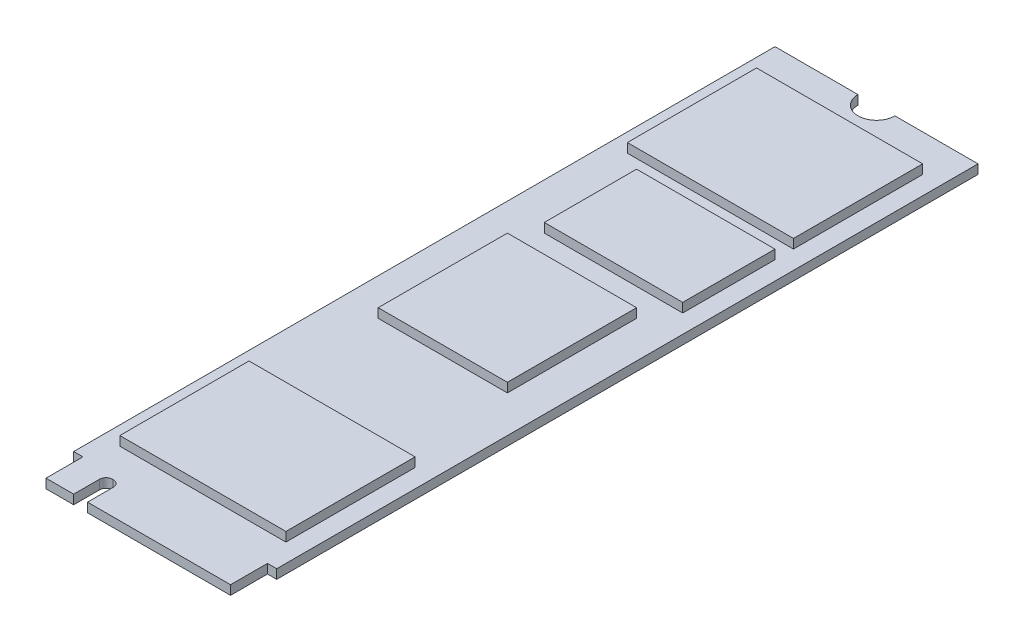
ISO-10303-21;
HEADER;
FILE_DESCRIPTION(('STEP AP214'),'2;1');
FILE_NAME('part.step','',(''),(''),'','','');
FILE_SCHEMA(('AUTOMOTIVE_DESIGN { 1 0 10303 214 1 1 1 1 }'));
ENDSEC;
DATA;
#1=APPLICATION_CONTEXT('core data for automotive mechanical design processes');
#2=APPLICATION_PROTOCOL_DEFINITION('international standard','automotive_design',2000,#1);
#3=PRODUCT_CONTEXT('',#1,'mechanical');
#4=PRODUCT('Part','Part','',(#3));
#5=PRODUCT_RELATED_PRODUCT_CATEGORY('part','',(#4));
#6=PRODUCT_DEFINITION_FORMATION('','',#4);
#7=PRODUCT_DEFINITION_CONTEXT('part definition',#1,'design');
#8=PRODUCT_DEFINITION('design','',#6,#7);
#9=PRODUCT_DEFINITION_SHAPE('','',#8);
#10=(LENGTH_UNIT() NAMED_UNIT(*) SI_UNIT(.MILLI.,.METRE.));
#11=(NAMED_UNIT(*) PLANE_ANGLE_UNIT() SI_UNIT($,.RADIAN.));
#12=(NAMED_UNIT(*) SI_UNIT($,.STERADIAN.) SOLID_ANGLE_UNIT());
#13=UNCERTAINTY_MEASURE_WITH_UNIT(LENGTH_MEASURE(1.E-05),#10,'distance_accuracy_value','');
#14=(GEOMETRIC_REPRESENTATION_CONTEXT(3) GLOBAL_UNCERTAINTY_ASSIGNED_CONTEXT((#13)) GLOBAL_UNIT_ASSIGNED_CONTEXT((#10,
#11,#12)) REPRESENTATION_CONTEXT('',''));
#15=CARTESIAN_POINT('',(0.,0.,0.));
#16=DIRECTION('',(0.,0.,1.));
#17=DIRECTION('',(1.,0.,0.));
#18=AXIS2_PLACEMENT_3D('',#15,#16,#17);
#19=CARTESIAN_POINT('',(-6.19999999999999,1.,37.2));
#20=DIRECTION('',(0.,1.,0.));
#21=DIRECTION('',(0.,0.,1.));
#22=AXIS2_PLACEMENT_3D('',#19,#20,#21);
#23=PLANE('',#22);
#24=CARTESIAN_POINT('',(0.,1.,-40.));
#25=DIRECTION('',(0.,1.,0.));
#26=DIRECTION('',(0.,0.,1.));
#27=AXIS2_PLACEMENT_3D('',#24,#25,#26);
#28=CIRCLE('',#27,2.);
#29=CARTESIAN_POINT('',(-2.00000000000001,1.,-40.));
#30=VERTEX_POINT('',#29);
#31=CARTESIAN_POINT('',(2.,1.,-40.));
#32=VERTEX_POINT('',#31);
#33=EDGE_CURVE('E369',#30,#32,#28,.T.);
#34=ORIENTED_EDGE('',*,*,#33,.F.);
#35=DIRECTION('',(-1.,0.,0.));
#36=VECTOR('',#35,1.);
#37=CARTESIAN_POINT('',(11.,1.,-40.));
#38=LINE('',#37,#36);
#39=CARTESIAN_POINT('',(-11.,1.,-40.));
#40=VERTEX_POINT('',#39);
#41=EDGE_CURVE('E392',#30,#40,#38,.T.);
#42=ORIENTED_EDGE('',*,*,#41,.T.);
#43=DIRECTION('',(0.,0.,1.));
#44=VECTOR('',#43,1.);
#45=CARTESIAN_POINT('',(-11.,1.,36.));
#46=LINE('',#45,#44);
#47=CARTESIAN_POINT('',(-11.,1.,36.));
#48=VERTEX_POINT('',#47);
#49=EDGE_CURVE('E396',#40,#48,#46,.T.);
#50=ORIENTED_EDGE('',*,*,#49,.T.);
#51=DIRECTION('',(1.,0.,0.));
#52=VECTOR('',#51,1.);
#53=CARTESIAN_POINT('',(-9.99999999999999,1.,36.));
#54=LINE('',#53,#52);
#55=CARTESIAN_POINT('',(-9.99999999999999,1.,36.));
#56=VERTEX_POINT('',#55);
#57=EDGE_CURVE('E398',#48,#56,#54,.T.);
#58=ORIENTED_EDGE('',*,*,#57,.T.);
#59=DIRECTION('',(0.,0.,1.));
#60=VECTOR('',#59,1.);
#61=CARTESIAN_POINT('',(-9.99999999999999,1.,40.));
#62=LINE('',#61,#60);
#63=CARTESIAN_POINT('',(-9.99999999999999,1.,40.));
#64=VERTEX_POINT('',#63);
#65=EDGE_CURVE('E400',#56,#64,#62,.T.);
#66=ORIENTED_EDGE('',*,*,#65,.T.);
#67=DIRECTION('',(1.,0.,0.));
#68=VECTOR('',#67,1.);
#69=CARTESIAN_POINT('',(-6.99999999999999,1.,40.));
#70=LINE('',#69,#68);
#71=CARTESIAN_POINT('',(-6.99999999999999,1.,40.));
#72=VERTEX_POINT('',#71);
#73=EDGE_CURVE('E402',#64,#72,#70,.T.);
#74=ORIENTED_EDGE('',*,*,#73,.T.);
#75=DIRECTION('',(0.,0.,-1.));
#76=VECTOR('',#75,1.);
#77=CARTESIAN_POINT('',(-7.,1.,37.2));
#78=LINE('',#77,#76);
#79=CARTESIAN_POINT('',(-7.,1.,37.2));
#80=VERTEX_POINT('',#79);
#81=EDGE_CURVE('E404',#72,#80,#78,.T.);
#82=ORIENTED_EDGE('',*,*,#81,.T.);
#83=CARTESIAN_POINT('',(-6.3,1.,37.2));
#84=DIRECTION('',(0.,-1.,0.));
#85=DIRECTION('',(0.,0.,1.));
#86=AXIS2_PLACEMENT_3D('',#83,#84,#85);
#87=CIRCLE('',#86,0.7);
#88=CARTESIAN_POINT('',(-6.29999999999999,1.,36.5));
#89=VERTEX_POINT('',#88);
#90=EDGE_CURVE('E406',#80,#89,#87,.T.);
#91=ORIENTED_EDGE('',*,*,#90,.T.);
#92=DIRECTION('',(1.,0.,0.));
#93=VECTOR('',#92,1.);
#94=CARTESIAN_POINT('',(-6.2,1.,36.5));
#95=LINE('',#94,#93);
#96=CARTESIAN_POINT('',(-6.2,1.,36.5));
#97=VERTEX_POINT('',#96);
#98=EDGE_CURVE('E408',#89,#97,#95,.T.);
#99=ORIENTED_EDGE('',*,*,#98,.T.);
#100=CARTESIAN_POINT('',(-6.19999999999999,1.,37.2));
#101=DIRECTION('',(0.,-1.,0.));
#102=DIRECTION('',(0.,0.,1.));
#103=AXIS2_PLACEMENT_3D('',#100,#101,#102);
#104=CIRCLE('',#103,0.7);
#105=CARTESIAN_POINT('',(-5.49999999999999,1.,37.2));
#106=VERTEX_POINT('',#105);
#107=EDGE_CURVE('E378',#97,#106,#104,.T.);
#108=ORIENTED_EDGE('',*,*,#107,.T.);
#109=DIRECTION('',(0.,0.,1.));
#110=VECTOR('',#109,1.);
#111=CARTESIAN_POINT('',(-5.49999999999999,1.,40.));
#112=LINE('',#111,#110);
#113=CARTESIAN_POINT('',(-5.49999999999999,1.,40.));
#114=VERTEX_POINT('',#113);
#115=EDGE_CURVE('E381',#106,#114,#112,.T.);
#116=ORIENTED_EDGE('',*,*,#115,.T.);
#117=DIRECTION('',(1.,0.,0.));
#118=VECTOR('',#117,1.);
#119=CARTESIAN_POINT('',(10.,1.,40.));
#120=LINE('',#119,#118);
#121=CARTESIAN_POINT('',(10.,1.,40.));
#122=VERTEX_POINT('',#121);
#123=EDGE_CURVE('E384',#114,#122,#120,.T.);
#124=ORIENTED_EDGE('',*,*,#123,.T.);
#125=DIRECTION('',(0.,0.,-1.));
#126=VECTOR('',#125,1.);
#127=CARTESIAN_POINT('',(10.,1.,36.));
#128=LINE('',#127,#126);
#129=CARTESIAN_POINT('',(10.,1.,36.));
#130=VERTEX_POINT('',#129);
#131=EDGE_CURVE('E386',#122,#130,#128,.T.);
#132=ORIENTED_EDGE('',*,*,#131,.T.);
#133=DIRECTION('',(1.,0.,0.));
#134=VECTOR('',#133,1.);
#135=CARTESIAN_POINT('',(11.,1.,36.));
#136=LINE('',#135,#134);
#137=CARTESIAN_POINT('',(11.,1.,36.));
#138=VERTEX_POINT('',#137);
#139=EDGE_CURVE('E388',#130,#138,#136,.T.);
#140=ORIENTED_EDGE('',*,*,#139,.T.);
#141=DIRECTION('',(0.,0.,-1.));
#142=VECTOR('',#141,1.);
#143=CARTESIAN_POINT('',(11.,1.,-40.));
#144=LINE('',#143,#142);
#145=CARTESIAN_POINT('',(11.,1.,-40.));
#146=VERTEX_POINT('',#145);
#147=EDGE_CURVE('E390',#138,#146,#144,.T.);
#148=ORIENTED_EDGE('',*,*,#147,.T.);
#149=EDGE_CURVE('E393',#146,#32,#38,.T.);
#150=ORIENTED_EDGE('',*,*,#149,.T.);
#151=EDGE_LOOP('',(#34,#42,#50,#58,#66,#74,#82,#91,#99,#108,#116,#124,#132,#140,#148,#150));
#152=FACE_BOUND('',#151,.T.);
#153=DIRECTION('',(1.,0.,0.));
#154=VECTOR('',#153,1.);
#155=CARTESIAN_POINT('',(-9.,1.,-22.));
#156=LINE('',#155,#154);
#157=CARTESIAN_POINT('',(-9.,1.,-22.));
#158=VERTEX_POINT('',#157);
#159=CARTESIAN_POINT('',(9.,1.,-22.));
#160=VERTEX_POINT('',#159);
#161=EDGE_CURVE('E354',#158,#160,#156,.T.);
#162=ORIENTED_EDGE('',*,*,#161,.F.);
#163=DIRECTION('',(0.,0.,1.));
#164=VECTOR('',#163,1.);
#165=CARTESIAN_POINT('',(-9.00000000000001,1.,-36.));
#166=LINE('',#165,#164);
#167=CARTESIAN_POINT('',(-9.00000000000001,1.,-36.));
#168=VERTEX_POINT('',#167);
#169=EDGE_CURVE('E340',#168,#158,#166,.T.);
#170=ORIENTED_EDGE('',*,*,#169,.F.);
#171=DIRECTION('',(-1.,0.,0.));
#172=VECTOR('',#171,1.);
#173=CARTESIAN_POINT('',(-9.00000000000001,1.,-36.));
#174=LINE('',#173,#172);
#175=CARTESIAN_POINT('',(8.99999999999999,1.,-36.));
#176=VERTEX_POINT('',#175);
#177=EDGE_CURVE('E345',#176,#168,#174,.T.);
#178=ORIENTED_EDGE('',*,*,#177,.F.);
#179=DIRECTION('',(0.,0.,-1.));
#180=VECTOR('',#179,1.);
#181=CARTESIAN_POINT('',(8.99999999999999,1.,-36.));
#182=LINE('',#181,#180);
#183=EDGE_CURVE('E356',#160,#176,#182,.T.);
#184=ORIENTED_EDGE('',*,*,#183,.F.);
#185=EDGE_LOOP('',(#162,#170,#178,#184));
#186=FACE_BOUND('',#185,.T.);
#187=DIRECTION('',(1.,0.,0.));
#188=VECTOR('',#187,1.);
#189=CARTESIAN_POINT('',(-6.99999999999999,1.,7.00000000000001));
#190=LINE('',#189,#188);
#191=CARTESIAN_POINT('',(-6.99999999999999,1.,7.00000000000001));
#192=VERTEX_POINT('',#191);
#193=CARTESIAN_POINT('',(7.00000000000001,1.,7.00000000000001));
#194=VERTEX_POINT('',#193);
#195=EDGE_CURVE('E325',#192,#194,#190,.T.);
#196=ORIENTED_EDGE('',*,*,#195,.F.);
#197=DIRECTION('',(0.,0.,1.));
#198=VECTOR('',#197,1.);
#199=CARTESIAN_POINT('',(-7.,1.,-6.99999999999999));
#200=LINE('',#199,#198);
#201=CARTESIAN_POINT('',(-7.,1.,-6.99999999999999));
#202=VERTEX_POINT('',#201);
#203=EDGE_CURVE('E311',#202,#192,#200,.T.);
#204=ORIENTED_EDGE('',*,*,#203,.F.);
#205=DIRECTION('',(-1.,0.,0.));
#206=VECTOR('',#205,1.);
#207=CARTESIAN_POINT('',(-7.,1.,-6.99999999999999));
#208=LINE('',#207,#206);
#209=CARTESIAN_POINT('',(7.,1.,-6.99999999999999));
#210=VERTEX_POINT('',#209);
#211=EDGE_CURVE('E316',#210,#202,#208,.T.);
#212=ORIENTED_EDGE('',*,*,#211,.F.);
#213=DIRECTION('',(0.,0.,-1.));
#214=VECTOR('',#213,1.);
#215=CARTESIAN_POINT('',(7.,1.,-6.99999999999999));
#216=LINE('',#215,#214);
#217=EDGE_CURVE('E327',#194,#210,#216,.T.);
#218=ORIENTED_EDGE('',*,*,#217,.F.);
#219=EDGE_LOOP('',(#196,#204,#212,#218));
#220=FACE_BOUND('',#219,.T.);
#221=DIRECTION('',(1.,0.,0.));
#222=VECTOR('',#221,1.);
#223=CARTESIAN_POINT('',(-6.,1.,-9.99999999999999));
#224=LINE('',#223,#222);
#225=CARTESIAN_POINT('',(-6.,1.,-9.99999999999999));
#226=VERTEX_POINT('',#225);
#227=CARTESIAN_POINT('',(9.00000000000001,1.,-9.99999999999999));
#228=VERTEX_POINT('',#227);
#229=EDGE_CURVE('E283',#226,#228,#224,.T.);
#230=ORIENTED_EDGE('',*,*,#229,.F.);
#231=DIRECTION('',(0.,0.,1.));
#232=VECTOR('',#231,1.);
#233=CARTESIAN_POINT('',(-6.,1.,-20.));
#234=LINE('',#233,#232);
#235=CARTESIAN_POINT('',(-6.,1.,-20.));
#236=VERTEX_POINT('',#235);
#237=EDGE_CURVE('E280',#236,#226,#234,.T.);
#238=ORIENTED_EDGE('',*,*,#237,.F.);
#239=DIRECTION('',(-1.,0.,0.));
#240=VECTOR('',#239,1.);
#241=CARTESIAN_POINT('',(-6.,1.,-20.));
#242=LINE('',#241,#240);
#243=CARTESIAN_POINT('',(9.,1.,-20.));
#244=VERTEX_POINT('',#243);
#245=EDGE_CURVE('E292',#244,#236,#242,.T.);
#246=ORIENTED_EDGE('',*,*,#245,.F.);
#247=DIRECTION('',(0.,0.,-1.));
#248=VECTOR('',#247,1.);
#249=CARTESIAN_POINT('',(9.,1.,-20.));
#250=LINE('',#249,#248);
#251=EDGE_CURVE('E300',#228,#244,#250,.T.);
#252=ORIENTED_EDGE('',*,*,#251,.F.);
#253=EDGE_LOOP('',(#230,#238,#246,#252));
#254=FACE_BOUND('',#253,.T.);
#255=DIRECTION('',(1.,0.,0.));
#256=VECTOR('',#255,1.);
#257=CARTESIAN_POINT('',(-9.,1.,33.));
#258=LINE('',#257,#256);
#259=CARTESIAN_POINT('',(-9.,1.,33.));
#260=VERTEX_POINT('',#259);
#261=CARTESIAN_POINT('',(9.,1.,33.));
#262=VERTEX_POINT('',#261);
#263=EDGE_CURVE('E984',#260,#262,#258,.T.);
#264=ORIENTED_EDGE('',*,*,#263,.F.);
#265=DIRECTION('',(0.,0.,1.));
#266=VECTOR('',#265,1.);
#267=CARTESIAN_POINT('',(-9.00000000000001,1.,19.));
#268=LINE('',#267,#266);
#269=CARTESIAN_POINT('',(-9.00000000000001,1.,19.));
#270=VERTEX_POINT('',#269);
#271=EDGE_CURVE('E278',#270,#260,#268,.T.);
#272=ORIENTED_EDGE('',*,*,#271,.F.);
#273=DIRECTION('',(-1.,0.,0.));
#274=VECTOR('',#273,1.);
#275=CARTESIAN_POINT('',(-9.00000000000001,1.,19.));
#276=LINE('',#275,#274);
#277=CARTESIAN_POINT('',(8.99999999999999,1.,19.));
#278=VERTEX_POINT('',#277);
#279=EDGE_CURVE('E274',#278,#270,#276,.T.);
#280=ORIENTED_EDGE('',*,*,#279,.F.);
#281=DIRECTION('',(0.,0.,-1.));
#282=VECTOR('',#281,1.);
#283=CARTESIAN_POINT('',(8.99999999999999,1.,19.));
#284=LINE('',#283,#282);
#285=EDGE_CURVE('E981',#262,#278,#284,.T.);
#286=ORIENTED_EDGE('',*,*,#285,.F.);
#287=EDGE_LOOP('',(#264,#272,#280,#286));
#288=FACE_BOUND('',#287,.T.);
#289=ADVANCED_FACE('F45',(#152,#186,#220,#254,#288),#23,.T.);
#290=CARTESIAN_POINT('',(11.,1.,-40.));
#291=DIRECTION('',(0.,0.,1.));
#292=DIRECTION('',(1.,0.,0.));
#293=AXIS2_PLACEMENT_3D('',#290,#291,#292);
#294=PLANE('',#293);
#295=DIRECTION('',(-1.,0.,0.));
#296=VECTOR('',#295,1.);
#297=CARTESIAN_POINT('',(11.,0.,-40.));
#298=LINE('',#297,#296);
#299=CARTESIAN_POINT('',(11.,0.,-40.));
#300=VERTEX_POINT('',#299);
#301=CARTESIAN_POINT('',(2.,0.,-40.));
#302=VERTEX_POINT('',#301);
#303=EDGE_CURVE('E424',#300,#302,#298,.T.);
#304=ORIENTED_EDGE('',*,*,#303,.T.);
#305=DIRECTION('',(0.,1.,0.));
#306=VECTOR('',#305,1.);
#307=CARTESIAN_POINT('',(2.,0.,-40.));
#308=LINE('',#307,#306);
#309=EDGE_CURVE('E374',#302,#32,#308,.T.);
#310=ORIENTED_EDGE('',*,*,#309,.T.);
#311=ORIENTED_EDGE('',*,*,#149,.F.);
#312=DIRECTION('',(0.,-1.,0.));
#313=VECTOR('',#312,1.);
#314=CARTESIAN_POINT('',(11.,1.,-40.));
#315=LINE('',#314,#313);
#316=EDGE_CURVE('E463',#146,#300,#315,.T.);
#317=ORIENTED_EDGE('',*,*,#316,.T.);
#318=EDGE_LOOP('',(#304,#310,#311,#317));
#319=FACE_BOUND('',#318,.T.);
#320=ADVANCED_FACE('F547',(#319),#294,.F.);
#321=CARTESIAN_POINT('',(-6.19999999999999,1.,37.2));
#322=DIRECTION('',(0.,-1.,0.));
#323=DIRECTION('',(0.,0.,-1.));
#324=AXIS2_PLACEMENT_3D('',#321,#322,#323);
#325=CYLINDRICAL_SURFACE('',#324,0.7);
#326=CARTESIAN_POINT('',(-6.19999999999999,0.,37.2));
#327=DIRECTION('',(0.,-1.,0.));
#328=DIRECTION('',(0.,0.,1.));
#329=AXIS2_PLACEMENT_3D('',#326,#327,#328);
#330=CIRCLE('',#329,0.7);
#331=CARTESIAN_POINT('',(-6.2,0.,36.5));
#332=VERTEX_POINT('',#331);
#333=CARTESIAN_POINT('',(-5.49999999999999,0.,37.2));
#334=VERTEX_POINT('',#333);
#335=EDGE_CURVE('E377',#332,#334,#330,.T.);
#336=ORIENTED_EDGE('',*,*,#335,.T.);
#337=DIRECTION('',(0.,-1.,0.));
#338=VECTOR('',#337,1.);
#339=CARTESIAN_POINT('',(-5.49999999999999,1.,37.2));
#340=LINE('',#339,#338);
#341=EDGE_CURVE('E53',#106,#334,#340,.T.);
#342=ORIENTED_EDGE('',*,*,#341,.F.);
#343=ORIENTED_EDGE('',*,*,#107,.F.);
#344=DIRECTION('',(0.,-1.,0.));
#345=VECTOR('',#344,1.);
#346=CARTESIAN_POINT('',(-6.2,1.,36.5));
#347=LINE('',#346,#345);
#348=EDGE_CURVE('E410',#97,#332,#347,.T.);
#349=ORIENTED_EDGE('',*,*,#348,.T.);
#350=EDGE_LOOP('',(#336,#342,#343,#349));
#351=FACE_BOUND('',#350,.T.);
#352=ADVANCED_FACE('F47',(#351),#325,.F.);
#353=CARTESIAN_POINT('',(-5.49999999999999,1.,40.));
#354=DIRECTION('',(1.,0.,0.));
#355=DIRECTION('',(0.,0.,-1.));
#356=AXIS2_PLACEMENT_3D('',#353,#354,#355);
#357=PLANE('',#356);
#358=DIRECTION('',(0.,0.,1.));
#359=VECTOR('',#358,1.);
#360=CARTESIAN_POINT('',(-5.49999999999999,0.,40.));
#361=LINE('',#360,#359);
#362=CARTESIAN_POINT('',(-5.49999999999999,0.,40.));
#363=VERTEX_POINT('',#362);
#364=EDGE_CURVE('E413',#334,#363,#361,.T.);
#365=ORIENTED_EDGE('',*,*,#364,.T.);
#366=DIRECTION('',(0.,-1.,0.));
#367=VECTOR('',#366,1.);
#368=CARTESIAN_POINT('',(-5.49999999999999,1.,40.));
#369=LINE('',#368,#367);
#370=EDGE_CURVE('E475',#114,#363,#369,.T.);
#371=ORIENTED_EDGE('',*,*,#370,.F.);
#372=ORIENTED_EDGE('',*,*,#115,.F.);
#373=ORIENTED_EDGE('',*,*,#341,.T.);
#374=EDGE_LOOP('',(#365,#371,#372,#373));
#375=FACE_BOUND('',#374,.T.);
#376=ADVANCED_FACE('F480',(#375),#357,.F.);
#377=CARTESIAN_POINT('',(10.,1.,40.));
#378=DIRECTION('',(0.,0.,-1.));
#379=DIRECTION('',(-1.,0.,0.));
#380=AXIS2_PLACEMENT_3D('',#377,#378,#379);
#381=PLANE('',#380);
#382=DIRECTION('',(1.,0.,0.));
#383=VECTOR('',#382,1.);
#384=CARTESIAN_POINT('',(10.,0.,40.));
#385=LINE('',#384,#383);
#386=CARTESIAN_POINT('',(10.,0.,40.));
#387=VERTEX_POINT('',#386);
#388=EDGE_CURVE('E415',#363,#387,#385,.T.);
#389=ORIENTED_EDGE('',*,*,#388,.T.);
#390=DIRECTION('',(0.,-1.,0.));
#391=VECTOR('',#390,1.);
#392=CARTESIAN_POINT('',(10.,1.,40.));
#393=LINE('',#392,#391);
#394=EDGE_CURVE('E472',#122,#387,#393,.T.);
#395=ORIENTED_EDGE('',*,*,#394,.F.);
#396=ORIENTED_EDGE('',*,*,#123,.F.);
#397=ORIENTED_EDGE('',*,*,#370,.T.);
#398=EDGE_LOOP('',(#389,#395,#396,#397));
#399=FACE_BOUND('',#398,.T.);
#400=ADVANCED_FACE('F496',(#399),#381,.F.);
#401=CARTESIAN_POINT('',(10.,1.,36.));
#402=DIRECTION('',(-1.,0.,0.));
#403=DIRECTION('',(0.,0.,1.));
#404=AXIS2_PLACEMENT_3D('',#401,#402,#403);
#405=PLANE('',#404);
#406=DIRECTION('',(0.,0.,-1.));
#407=VECTOR('',#406,1.);
#408=CARTESIAN_POINT('',(10.,0.,36.));
#409=LINE('',#408,#407);
#410=CARTESIAN_POINT('',(10.,0.,36.));
#411=VERTEX_POINT('',#410);
#412=EDGE_CURVE('E417',#387,#411,#409,.T.);
#413=ORIENTED_EDGE('',*,*,#412,.T.);
#414=DIRECTION('',(0.,-1.,0.));
#415=VECTOR('',#414,1.);
#416=CARTESIAN_POINT('',(10.,1.,36.));
#417=LINE('',#416,#415);
#418=EDGE_CURVE('E469',#130,#411,#417,.T.);
#419=ORIENTED_EDGE('',*,*,#418,.F.);
#420=ORIENTED_EDGE('',*,*,#131,.F.);
#421=ORIENTED_EDGE('',*,*,#394,.T.);
#422=EDGE_LOOP('',(#413,#419,#420,#421));
#423=FACE_BOUND('',#422,.T.);
#424=ADVANCED_FACE('F500',(#423),#405,.F.);
#425=CARTESIAN_POINT('',(11.,1.,36.));
#426=DIRECTION('',(0.,0.,-1.));
#427=DIRECTION('',(-1.,0.,0.));
#428=AXIS2_PLACEMENT_3D('',#425,#426,#427);
#429=PLANE('',#428);
#430=DIRECTION('',(1.,0.,0.));
#431=VECTOR('',#430,1.);
#432=CARTESIAN_POINT('',(11.,0.,36.));
#433=LINE('',#432,#431);
#434=CARTESIAN_POINT('',(11.,0.,36.));
#435=VERTEX_POINT('',#434);
#436=EDGE_CURVE('E419',#411,#435,#433,.T.);
#437=ORIENTED_EDGE('',*,*,#436,.T.);
#438=DIRECTION('',(0.,-1.,0.));
#439=VECTOR('',#438,1.);
#440=CARTESIAN_POINT('',(11.,1.,36.));
#441=LINE('',#440,#439);
#442=EDGE_CURVE('E466',#138,#435,#441,.T.);
#443=ORIENTED_EDGE('',*,*,#442,.F.);
#444=ORIENTED_EDGE('',*,*,#139,.F.);
#445=ORIENTED_EDGE('',*,*,#418,.T.);
#446=EDGE_LOOP('',(#437,#443,#444,#445));
#447=FACE_BOUND('',#446,.T.);
#448=ADVANCED_FACE('F554',(#447),#429,.F.);
#449=CARTESIAN_POINT('',(11.,1.,-40.));
#450=DIRECTION('',(-1.,0.,0.));
#451=DIRECTION('',(0.,0.,1.));
#452=AXIS2_PLACEMENT_3D('',#449,#450,#451);
#453=PLANE('',#452);
#454=DIRECTION('',(0.,0.,-1.));
#455=VECTOR('',#454,1.);
#456=CARTESIAN_POINT('',(11.,0.,-40.));
#457=LINE('',#456,#455);
#458=EDGE_CURVE('E421',#435,#300,#457,.T.);
#459=ORIENTED_EDGE('',*,*,#458,.T.);
#460=ORIENTED_EDGE('',*,*,#316,.F.);
#461=ORIENTED_EDGE('',*,*,#147,.F.);
#462=ORIENTED_EDGE('',*,*,#442,.T.);
#463=EDGE_LOOP('',(#459,#460,#461,#462));
#464=FACE_BOUND('',#463,.T.);
#465=ADVANCED_FACE('F552',(#464),#453,.F.);
#466=ORIENTED_EDGE('',*,*,#41,.F.);
#467=DIRECTION('',(0.,1.,0.));
#468=VECTOR('',#467,1.);
#469=CARTESIAN_POINT('',(-2.00000000000001,0.,-40.));
#470=LINE('',#469,#468);
#471=CARTESIAN_POINT('',(-2.00000000000001,0.,-40.));
#472=VERTEX_POINT('',#471);
#473=EDGE_CURVE('E371',#30,#472,#470,.F.);
#474=ORIENTED_EDGE('',*,*,#473,.T.);
#475=CARTESIAN_POINT('',(-11.,0.,-40.));
#476=VERTEX_POINT('',#475);
#477=EDGE_CURVE('E423',#472,#476,#298,.T.);
#478=ORIENTED_EDGE('',*,*,#477,.T.);
#479=DIRECTION('',(0.,-1.,0.));
#480=VECTOR('',#479,1.);
#481=CARTESIAN_POINT('',(-11.,1.,-40.));
#482=LINE('',#481,#480);
#483=EDGE_CURVE('E460',#40,#476,#482,.T.);
#484=ORIENTED_EDGE('',*,*,#483,.F.);
#485=EDGE_LOOP('',(#466,#474,#478,#484));
#486=FACE_BOUND('',#485,.T.);
#487=ADVANCED_FACE('F542',(#486),#294,.F.);
#488=CARTESIAN_POINT('',(-11.,1.,36.));
#489=DIRECTION('',(1.,0.,0.));
#490=DIRECTION('',(0.,0.,-1.));
#491=AXIS2_PLACEMENT_3D('',#488,#489,#490);
#492=PLANE('',#491);
#493=DIRECTION('',(0.,0.,1.));
#494=VECTOR('',#493,1.);
#495=CARTESIAN_POINT('',(-11.,0.,36.));
#496=LINE('',#495,#494);
#497=CARTESIAN_POINT('',(-11.,0.,36.));
#498=VERTEX_POINT('',#497);
#499=EDGE_CURVE('E427',#476,#498,#496,.T.);
#500=ORIENTED_EDGE('',*,*,#499,.T.);
#501=DIRECTION('',(0.,-1.,0.));
#502=VECTOR('',#501,1.);
#503=CARTESIAN_POINT('',(-11.,1.,36.));
#504=LINE('',#503,#502);
#505=EDGE_CURVE('E457',#48,#498,#504,.T.);
#506=ORIENTED_EDGE('',*,*,#505,.F.);
#507=ORIENTED_EDGE('',*,*,#49,.F.);
#508=ORIENTED_EDGE('',*,*,#483,.T.);
#509=EDGE_LOOP('',(#500,#506,#507,#508));
#510=FACE_BOUND('',#509,.T.);
#511=ADVANCED_FACE('F538',(#510),#492,.F.);
#512=CARTESIAN_POINT('',(-9.99999999999999,1.,36.));
#513=DIRECTION('',(0.,0.,-1.));
#514=DIRECTION('',(-1.,0.,0.));
#515=AXIS2_PLACEMENT_3D('',#512,#513,#514);
#516=PLANE('',#515);
#517=DIRECTION('',(1.,0.,0.));
#518=VECTOR('',#517,1.);
#519=CARTESIAN_POINT('',(-9.99999999999999,0.,36.));
#520=LINE('',#519,#518);
#521=CARTESIAN_POINT('',(-9.99999999999999,0.,36.));
#522=VERTEX_POINT('',#521);
#523=EDGE_CURVE('E429',#498,#522,#520,.T.);
#524=ORIENTED_EDGE('',*,*,#523,.T.);
#525=DIRECTION('',(0.,-1.,0.));
#526=VECTOR('',#525,1.);
#527=CARTESIAN_POINT('',(-9.99999999999999,1.,36.));
#528=LINE('',#527,#526);
#529=EDGE_CURVE('E454',#56,#522,#528,.T.);
#530=ORIENTED_EDGE('',*,*,#529,.F.);
#531=ORIENTED_EDGE('',*,*,#57,.F.);
#532=ORIENTED_EDGE('',*,*,#505,.T.);
#533=EDGE_LOOP('',(#524,#530,#531,#532));
#534=FACE_BOUND('',#533,.T.);
#535=ADVANCED_FACE('F533',(#534),#516,.F.);
#536=CARTESIAN_POINT('',(-9.99999999999999,1.,40.));
#537=DIRECTION('',(1.,0.,0.));
#538=DIRECTION('',(0.,0.,-1.));
#539=AXIS2_PLACEMENT_3D('',#536,#537,#538);
#540=PLANE('',#539);
#541=DIRECTION('',(0.,0.,1.));
#542=VECTOR('',#541,1.);
#543=CARTESIAN_POINT('',(-9.99999999999999,0.,40.));
#544=LINE('',#543,#542);
#545=CARTESIAN_POINT('',(-9.99999999999999,0.,40.));
#546=VERTEX_POINT('',#545);
#547=EDGE_CURVE('E431',#522,#546,#544,.T.);
#548=ORIENTED_EDGE('',*,*,#547,.T.);
#549=DIRECTION('',(0.,-1.,0.));
#550=VECTOR('',#549,1.);
#551=CARTESIAN_POINT('',(-9.99999999999999,1.,40.));
#552=LINE('',#551,#550);
#553=EDGE_CURVE('E451',#64,#546,#552,.T.);
#554=ORIENTED_EDGE('',*,*,#553,.F.);
#555=ORIENTED_EDGE('',*,*,#65,.F.);
#556=ORIENTED_EDGE('',*,*,#529,.T.);
#557=EDGE_LOOP('',(#548,#554,#555,#556));
#558=FACE_BOUND('',#557,.T.);
#559=ADVANCED_FACE('F528',(#558),#540,.F.);
#560=CARTESIAN_POINT('',(-6.99999999999999,1.,40.));
#561=DIRECTION('',(0.,0.,-1.));
#562=DIRECTION('',(-1.,0.,0.));
#563=AXIS2_PLACEMENT_3D('',#560,#561,#562);
#564=PLANE('',#563);
#565=DIRECTION('',(1.,0.,0.));
#566=VECTOR('',#565,1.);
#567=CARTESIAN_POINT('',(-6.99999999999999,0.,40.));
#568=LINE('',#567,#566);
#569=CARTESIAN_POINT('',(-6.99999999999999,0.,40.));
#570=VERTEX_POINT('',#569);
#571=EDGE_CURVE('E433',#546,#570,#568,.T.);
#572=ORIENTED_EDGE('',*,*,#571,.T.);
#573=DIRECTION('',(0.,-1.,0.));
#574=VECTOR('',#573,1.);
#575=CARTESIAN_POINT('',(-6.99999999999999,1.,40.));
#576=LINE('',#575,#574);
#577=EDGE_CURVE('E448',#72,#570,#576,.T.);
#578=ORIENTED_EDGE('',*,*,#577,.F.);
#579=ORIENTED_EDGE('',*,*,#73,.F.);
#580=ORIENTED_EDGE('',*,*,#553,.T.);
#581=EDGE_LOOP('',(#572,#578,#579,#580));
#582=FACE_BOUND('',#581,.T.);
#583=ADVANCED_FACE('F524',(#582),#564,.F.);
#584=CARTESIAN_POINT('',(-7.,1.,37.2));
#585=DIRECTION('',(-1.,0.,0.));
#586=DIRECTION('',(0.,0.,1.));
#587=AXIS2_PLACEMENT_3D('',#584,#585,#586);
#588=PLANE('',#587);
#589=DIRECTION('',(0.,0.,-1.));
#590=VECTOR('',#589,1.);
#591=CARTESIAN_POINT('',(-7.,0.,37.2));
#592=LINE('',#591,#590);
#593=CARTESIAN_POINT('',(-7.,0.,37.2));
#594=VERTEX_POINT('',#593);
#595=EDGE_CURVE('E435',#570,#594,#592,.T.);
#596=ORIENTED_EDGE('',*,*,#595,.T.);
#597=DIRECTION('',(0.,-1.,0.));
#598=VECTOR('',#597,1.);
#599=CARTESIAN_POINT('',(-7.,1.,37.2));
#600=LINE('',#599,#598);
#601=EDGE_CURVE('E445',#80,#594,#600,.T.);
#602=ORIENTED_EDGE('',*,*,#601,.F.);
#603=ORIENTED_EDGE('',*,*,#81,.F.);
#604=ORIENTED_EDGE('',*,*,#577,.T.);
#605=EDGE_LOOP('',(#596,#602,#603,#604));
#606=FACE_BOUND('',#605,.T.);
#607=ADVANCED_FACE('F519',(#606),#588,.F.);
#608=CARTESIAN_POINT('',(-6.3,1.,37.2));
#609=DIRECTION('',(0.,-1.,0.));
#610=DIRECTION('',(0.,0.,-1.));
#611=AXIS2_PLACEMENT_3D('',#608,#609,#610);
#612=CYLINDRICAL_SURFACE('',#611,0.7);
#613=CARTESIAN_POINT('',(-6.3,0.,37.2));
#614=DIRECTION('',(0.,-1.,0.));
#615=DIRECTION('',(0.,0.,1.));
#616=AXIS2_PLACEMENT_3D('',#613,#614,#615);
#617=CIRCLE('',#616,0.7);
#618=CARTESIAN_POINT('',(-6.29999999999999,0.,36.5));
#619=VERTEX_POINT('',#618);
#620=EDGE_CURVE('E437',#594,#619,#617,.T.);
#621=ORIENTED_EDGE('',*,*,#620,.T.);
#622=DIRECTION('',(0.,-1.,0.));
#623=VECTOR('',#622,1.);
#624=CARTESIAN_POINT('',(-6.29999999999999,1.,36.5));
#625=LINE('',#624,#623);
#626=EDGE_CURVE('E442',#89,#619,#625,.T.);
#627=ORIENTED_EDGE('',*,*,#626,.F.);
#628=ORIENTED_EDGE('',*,*,#90,.F.);
#629=ORIENTED_EDGE('',*,*,#601,.T.);
#630=EDGE_LOOP('',(#621,#627,#628,#629));
#631=FACE_BOUND('',#630,.T.);
#632=ADVANCED_FACE('F513',(#631),#612,.F.);
#633=CARTESIAN_POINT('',(-6.2,1.,36.5));
#634=DIRECTION('',(0.,0.,-1.));
#635=DIRECTION('',(-1.,0.,0.));
#636=AXIS2_PLACEMENT_3D('',#633,#634,#635);
#637=PLANE('',#636);
#638=DIRECTION('',(1.,0.,0.));
#639=VECTOR('',#638,1.);
#640=CARTESIAN_POINT('',(-6.2,0.,36.5));
#641=LINE('',#640,#639);
#642=EDGE_CURVE('E382',#619,#332,#641,.T.);
#643=ORIENTED_EDGE('',*,*,#642,.T.);
#644=ORIENTED_EDGE('',*,*,#348,.F.);
#645=ORIENTED_EDGE('',*,*,#98,.F.);
#646=ORIENTED_EDGE('',*,*,#626,.T.);
#647=EDGE_LOOP('',(#643,#644,#645,#646));
#648=FACE_BOUND('',#647,.T.);
#649=ADVANCED_FACE('F511',(#648),#637,.F.);
#650=CARTESIAN_POINT('',(-6.19999999999999,0.,37.2));
#651=DIRECTION('',(0.,1.,0.));
#652=DIRECTION('',(0.,0.,1.));
#653=AXIS2_PLACEMENT_3D('',#650,#651,#652);
#654=PLANE('',#653);
#655=ORIENTED_EDGE('',*,*,#477,.F.);
#656=CARTESIAN_POINT('',(0.,0.,-40.));
#657=DIRECTION('',(0.,1.,0.));
#658=DIRECTION('',(0.,0.,1.));
#659=AXIS2_PLACEMENT_3D('',#656,#657,#658);
#660=CIRCLE('',#659,2.);
#661=EDGE_CURVE('E11',#472,#302,#660,.T.);
#662=ORIENTED_EDGE('',*,*,#661,.T.);
#663=ORIENTED_EDGE('',*,*,#303,.F.);
#664=ORIENTED_EDGE('',*,*,#458,.F.);
#665=ORIENTED_EDGE('',*,*,#436,.F.);
#666=ORIENTED_EDGE('',*,*,#412,.F.);
#667=ORIENTED_EDGE('',*,*,#388,.F.);
#668=ORIENTED_EDGE('',*,*,#364,.F.);
#669=ORIENTED_EDGE('',*,*,#335,.F.);
#670=ORIENTED_EDGE('',*,*,#642,.F.);
#671=ORIENTED_EDGE('',*,*,#620,.F.);
#672=ORIENTED_EDGE('',*,*,#595,.F.);
#673=ORIENTED_EDGE('',*,*,#571,.F.);
#674=ORIENTED_EDGE('',*,*,#547,.F.);
#675=ORIENTED_EDGE('',*,*,#523,.F.);
#676=ORIENTED_EDGE('',*,*,#499,.F.);
#677=EDGE_LOOP('',(#655,#662,#663,#664,#665,#666,#667,#668,#669,#670,#671,#672,#673,#674,#675,#676));
#678=FACE_BOUND('',#677,.T.);
#679=ADVANCED_FACE('F489',(#678),#654,.F.);
#680=CARTESIAN_POINT('',(0.,0.,-40.));
#681=DIRECTION('',(0.,1.,0.));
#682=DIRECTION('',(0.,0.,1.));
#683=AXIS2_PLACEMENT_3D('',#680,#681,#682);
#684=CYLINDRICAL_SURFACE('',#683,2.);
#685=ORIENTED_EDGE('',*,*,#661,.F.);
#686=ORIENTED_EDGE('',*,*,#473,.F.);
#687=ORIENTED_EDGE('',*,*,#33,.T.);
#688=ORIENTED_EDGE('',*,*,#309,.F.);
#689=EDGE_LOOP('',(#685,#686,#687,#688));
#690=FACE_BOUND('',#689,.T.);
#691=ADVANCED_FACE('F571',(#690),#684,.F.);
#692=CARTESIAN_POINT('',(-9.00000000000001,2.,-36.));
#693=DIRECTION('',(1.,0.,0.));
#694=DIRECTION('',(0.,0.,-1.));
#695=AXIS2_PLACEMENT_3D('',#692,#693,#694);
#696=PLANE('',#695);
#697=ORIENTED_EDGE('',*,*,#169,.T.);
#698=DIRECTION('',(0.,-1.,0.));
#699=VECTOR('',#698,1.);
#700=CARTESIAN_POINT('',(-9.,2.,-22.));
#701=LINE('',#700,#699);
#702=CARTESIAN_POINT('',(-9.,2.,-22.));
#703=VERTEX_POINT('',#702);
#704=EDGE_CURVE('E367',#703,#158,#701,.T.);
#705=ORIENTED_EDGE('',*,*,#704,.F.);
#706=DIRECTION('',(0.,0.,1.));
#707=VECTOR('',#706,1.);
#708=CARTESIAN_POINT('',(-9.00000000000001,2.,-36.));
#709=LINE('',#708,#707);
#710=CARTESIAN_POINT('',(-9.00000000000001,2.,-36.));
#711=VERTEX_POINT('',#710);
#712=EDGE_CURVE('E341',#711,#703,#709,.T.);
#713=ORIENTED_EDGE('',*,*,#712,.F.);
#714=DIRECTION('',(0.,-1.,0.));
#715=VECTOR('',#714,1.);
#716=CARTESIAN_POINT('',(-9.00000000000001,2.,-36.));
#717=LINE('',#716,#715);
#718=EDGE_CURVE('E351',#711,#168,#717,.T.);
#719=ORIENTED_EDGE('',*,*,#718,.T.);
#720=EDGE_LOOP('',(#697,#705,#713,#719));
#721=FACE_BOUND('',#720,.T.);
#722=ADVANCED_FACE('F631',(#721),#696,.F.);
#723=CARTESIAN_POINT('',(-9.,2.,-22.));
#724=DIRECTION('',(0.,0.,-1.));
#725=DIRECTION('',(-1.,0.,0.));
#726=AXIS2_PLACEMENT_3D('',#723,#724,#725);
#727=PLANE('',#726);
#728=ORIENTED_EDGE('',*,*,#161,.T.);
#729=DIRECTION('',(0.,-1.,0.));
#730=VECTOR('',#729,1.);
#731=CARTESIAN_POINT('',(9.,2.,-22.));
#732=LINE('',#731,#730);
#733=CARTESIAN_POINT('',(9.,2.,-22.));
#734=VERTEX_POINT('',#733);
#735=EDGE_CURVE('E364',#734,#160,#732,.T.);
#736=ORIENTED_EDGE('',*,*,#735,.F.);
#737=DIRECTION('',(1.,0.,0.));
#738=VECTOR('',#737,1.);
#739=CARTESIAN_POINT('',(-9.,2.,-22.));
#740=LINE('',#739,#738);
#741=EDGE_CURVE('E344',#703,#734,#740,.T.);
#742=ORIENTED_EDGE('',*,*,#741,.F.);
#743=ORIENTED_EDGE('',*,*,#704,.T.);
#744=EDGE_LOOP('',(#728,#736,#742,#743));
#745=FACE_BOUND('',#744,.T.);
#746=ADVANCED_FACE('F637',(#745),#727,.F.);
#747=CARTESIAN_POINT('',(8.99999999999999,2.,-36.));
#748=DIRECTION('',(-1.,0.,0.));
#749=DIRECTION('',(0.,0.,1.));
#750=AXIS2_PLACEMENT_3D('',#747,#748,#749);
#751=PLANE('',#750);
#752=ORIENTED_EDGE('',*,*,#183,.T.);
#753=DIRECTION('',(0.,-1.,0.));
#754=VECTOR('',#753,1.);
#755=CARTESIAN_POINT('',(8.99999999999999,2.,-36.));
#756=LINE('',#755,#754);
#757=CARTESIAN_POINT('',(8.99999999999999,2.,-36.));
#758=VERTEX_POINT('',#757);
#759=EDGE_CURVE('E362',#758,#176,#756,.T.);
#760=ORIENTED_EDGE('',*,*,#759,.F.);
#761=DIRECTION('',(0.,0.,-1.));
#762=VECTOR('',#761,1.);
#763=CARTESIAN_POINT('',(8.99999999999999,2.,-36.));
#764=LINE('',#763,#762);
#765=EDGE_CURVE('E347',#734,#758,#764,.T.);
#766=ORIENTED_EDGE('',*,*,#765,.F.);
#767=ORIENTED_EDGE('',*,*,#735,.T.);
#768=EDGE_LOOP('',(#752,#760,#766,#767));
#769=FACE_BOUND('',#768,.T.);
#770=ADVANCED_FACE('F644',(#769),#751,.F.);
#771=CARTESIAN_POINT('',(-9.00000000000001,2.,-36.));
#772=DIRECTION('',(0.,0.,1.));
#773=DIRECTION('',(1.,0.,0.));
#774=AXIS2_PLACEMENT_3D('',#771,#772,#773);
#775=PLANE('',#774);
#776=ORIENTED_EDGE('',*,*,#177,.T.);
#777=ORIENTED_EDGE('',*,*,#718,.F.);
#778=DIRECTION('',(-1.,0.,0.));
#779=VECTOR('',#778,1.);
#780=CARTESIAN_POINT('',(-9.00000000000001,2.,-36.));
#781=LINE('',#780,#779);
#782=EDGE_CURVE('E349',#758,#711,#781,.T.);
#783=ORIENTED_EDGE('',*,*,#782,.F.);
#784=ORIENTED_EDGE('',*,*,#759,.T.);
#785=EDGE_LOOP('',(#776,#777,#783,#784));
#786=FACE_BOUND('',#785,.T.);
#787=ADVANCED_FACE('F652',(#786),#775,.F.);
#788=CARTESIAN_POINT('',(0.,2.,0.));
#789=DIRECTION('',(0.,1.,0.));
#790=DIRECTION('',(0.,0.,1.));
#791=AXIS2_PLACEMENT_3D('',#788,#789,#790);
#792=PLANE('',#791);
#793=ORIENTED_EDGE('',*,*,#712,.T.);
#794=ORIENTED_EDGE('',*,*,#741,.T.);
#795=ORIENTED_EDGE('',*,*,#765,.T.);
#796=ORIENTED_EDGE('',*,*,#782,.T.);
#797=EDGE_LOOP('',(#793,#794,#795,#796));
#798=FACE_BOUND('',#797,.T.);
#799=ADVANCED_FACE('F660',(#798),#792,.T.);
#800=CARTESIAN_POINT('',(-7.,2.,-6.99999999999999));
#801=DIRECTION('',(1.,0.,0.));
#802=DIRECTION('',(0.,0.,-1.));
#803=AXIS2_PLACEMENT_3D('',#800,#801,#802);
#804=PLANE('',#803);
#805=ORIENTED_EDGE('',*,*,#203,.T.);
#806=DIRECTION('',(0.,-1.,0.));
#807=VECTOR('',#806,1.);
#808=CARTESIAN_POINT('',(-6.99999999999999,2.,7.00000000000001));
#809=LINE('',#808,#807);
#810=CARTESIAN_POINT('',(-6.99999999999999,2.,7.00000000000001));
#811=VERTEX_POINT('',#810);
#812=EDGE_CURVE('E338',#811,#192,#809,.T.);
#813=ORIENTED_EDGE('',*,*,#812,.F.);
#814=DIRECTION('',(0.,0.,1.));
#815=VECTOR('',#814,1.);
#816=CARTESIAN_POINT('',(-7.,2.,-6.99999999999999));
#817=LINE('',#816,#815);
#818=CARTESIAN_POINT('',(-7.,2.,-6.99999999999999));
#819=VERTEX_POINT('',#818);
#820=EDGE_CURVE('E312',#819,#811,#817,.T.);
#821=ORIENTED_EDGE('',*,*,#820,.F.);
#822=DIRECTION('',(0.,-1.,0.));
#823=VECTOR('',#822,1.);
#824=CARTESIAN_POINT('',(-7.,2.,-6.99999999999999));
#825=LINE('',#824,#823);
#826=EDGE_CURVE('E322',#819,#202,#825,.T.);
#827=ORIENTED_EDGE('',*,*,#826,.T.);
#828=EDGE_LOOP('',(#805,#813,#821,#827));
#829=FACE_BOUND('',#828,.T.);
#830=ADVANCED_FACE('F668',(#829),#804,.F.);
#831=CARTESIAN_POINT('',(-6.99999999999999,2.,7.00000000000001));
#832=DIRECTION('',(0.,0.,-1.));
#833=DIRECTION('',(-1.,0.,0.));
#834=AXIS2_PLACEMENT_3D('',#831,#832,#833);
#835=PLANE('',#834);
#836=ORIENTED_EDGE('',*,*,#195,.T.);
#837=DIRECTION('',(0.,-1.,0.));
#838=VECTOR('',#837,1.);
#839=CARTESIAN_POINT('',(7.00000000000001,2.,7.00000000000001));
#840=LINE('',#839,#838);
#841=CARTESIAN_POINT('',(7.00000000000001,2.,7.00000000000001));
#842=VERTEX_POINT('',#841);
#843=EDGE_CURVE('E335',#842,#194,#840,.T.);
#844=ORIENTED_EDGE('',*,*,#843,.F.);
#845=DIRECTION('',(1.,0.,0.));
#846=VECTOR('',#845,1.);
#847=CARTESIAN_POINT('',(-6.99999999999999,2.,7.00000000000001));
#848=LINE('',#847,#846);
#849=EDGE_CURVE('E315',#811,#842,#848,.T.);
#850=ORIENTED_EDGE('',*,*,#849,.F.);
#851=ORIENTED_EDGE('',*,*,#812,.T.);
#852=EDGE_LOOP('',(#836,#844,#850,#851));
#853=FACE_BOUND('',#852,.T.);
#854=ADVANCED_FACE('F676',(#853),#835,.F.);
#855=CARTESIAN_POINT('',(7.,2.,-6.99999999999999));
#856=DIRECTION('',(-1.,0.,0.));
#857=DIRECTION('',(0.,0.,1.));
#858=AXIS2_PLACEMENT_3D('',#855,#856,#857);
#859=PLANE('',#858);
#860=ORIENTED_EDGE('',*,*,#217,.T.);
#861=DIRECTION('',(0.,-1.,0.));
#862=VECTOR('',#861,1.);
#863=CARTESIAN_POINT('',(7.,2.,-6.99999999999999));
#864=LINE('',#863,#862);
#865=CARTESIAN_POINT('',(7.,2.,-6.99999999999999));
#866=VERTEX_POINT('',#865);
#867=EDGE_CURVE('E333',#866,#210,#864,.T.);
#868=ORIENTED_EDGE('',*,*,#867,.F.);
#869=DIRECTION('',(0.,0.,-1.));
#870=VECTOR('',#869,1.);
#871=CARTESIAN_POINT('',(7.,2.,-6.99999999999999));
#872=LINE('',#871,#870);
#873=EDGE_CURVE('E318',#842,#866,#872,.T.);
#874=ORIENTED_EDGE('',*,*,#873,.F.);
#875=ORIENTED_EDGE('',*,*,#843,.T.);
#876=EDGE_LOOP('',(#860,#868,#874,#875));
#877=FACE_BOUND('',#876,.T.);
#878=ADVANCED_FACE('F684',(#877),#859,.F.);
#879=CARTESIAN_POINT('',(-7.,2.,-6.99999999999999));
#880=DIRECTION('',(0.,0.,1.));
#881=DIRECTION('',(1.,0.,0.));
#882=AXIS2_PLACEMENT_3D('',#879,#880,#881);
#883=PLANE('',#882);
#884=ORIENTED_EDGE('',*,*,#211,.T.);
#885=ORIENTED_EDGE('',*,*,#826,.F.);
#886=DIRECTION('',(-1.,0.,0.));
#887=VECTOR('',#886,1.);
#888=CARTESIAN_POINT('',(-7.,2.,-6.99999999999999));
#889=LINE('',#888,#887);
#890=EDGE_CURVE('E320',#866,#819,#889,.T.);
#891=ORIENTED_EDGE('',*,*,#890,.F.);
#892=ORIENTED_EDGE('',*,*,#867,.T.);
#893=EDGE_LOOP('',(#884,#885,#891,#892));
#894=FACE_BOUND('',#893,.T.);
#895=ADVANCED_FACE('F692',(#894),#883,.F.);
#896=CARTESIAN_POINT('',(0.,2.,0.));
#897=DIRECTION('',(0.,1.,0.));
#898=DIRECTION('',(0.,0.,1.));
#899=AXIS2_PLACEMENT_3D('',#896,#897,#898);
#900=PLANE('',#899);
#901=ORIENTED_EDGE('',*,*,#820,.T.);
#902=ORIENTED_EDGE('',*,*,#849,.T.);
#903=ORIENTED_EDGE('',*,*,#873,.T.);
#904=ORIENTED_EDGE('',*,*,#890,.T.);
#905=EDGE_LOOP('',(#901,#902,#903,#904));
#906=FACE_BOUND('',#905,.T.);
#907=ADVANCED_FACE('F700',(#906),#900,.T.);
#908=CARTESIAN_POINT('',(-6.,2.,-20.));
#909=DIRECTION('',(1.,0.,0.));
#910=DIRECTION('',(0.,0.,-1.));
#911=AXIS2_PLACEMENT_3D('',#908,#909,#910);
#912=PLANE('',#911);
#913=ORIENTED_EDGE('',*,*,#237,.T.);
#914=DIRECTION('',(0.,-1.,0.));
#915=VECTOR('',#914,1.);
#916=CARTESIAN_POINT('',(-6.,2.,-9.99999999999999));
#917=LINE('',#916,#915);
#918=CARTESIAN_POINT('',(-6.,2.,-9.99999999999999));
#919=VERTEX_POINT('',#918);
#920=EDGE_CURVE('E309',#919,#226,#917,.T.);
#921=ORIENTED_EDGE('',*,*,#920,.F.);
#922=DIRECTION('',(0.,0.,1.));
#923=VECTOR('',#922,1.);
#924=CARTESIAN_POINT('',(-6.,2.,-20.));
#925=LINE('',#924,#923);
#926=CARTESIAN_POINT('',(-6.,2.,-20.));
#927=VERTEX_POINT('',#926);
#928=EDGE_CURVE('E288',#927,#919,#925,.T.);
#929=ORIENTED_EDGE('',*,*,#928,.F.);
#930=DIRECTION('',(0.,-1.,0.));
#931=VECTOR('',#930,1.);
#932=CARTESIAN_POINT('',(-6.,2.,-20.));
#933=LINE('',#932,#931);
#934=EDGE_CURVE('E297',#927,#236,#933,.T.);
#935=ORIENTED_EDGE('',*,*,#934,.T.);
#936=EDGE_LOOP('',(#913,#921,#929,#935));
#937=FACE_BOUND('',#936,.T.);
#938=ADVANCED_FACE('F708',(#937),#912,.F.);
#939=CARTESIAN_POINT('',(-6.,2.,-9.99999999999999));
#940=DIRECTION('',(0.,0.,-1.));
#941=DIRECTION('',(-1.,0.,0.));
#942=AXIS2_PLACEMENT_3D('',#939,#940,#941);
#943=PLANE('',#942);
#944=ORIENTED_EDGE('',*,*,#229,.T.);
#945=DIRECTION('',(0.,-1.,0.));
#946=VECTOR('',#945,1.);
#947=CARTESIAN_POINT('',(9.00000000000001,2.,-9.99999999999999));
#948=LINE('',#947,#946);
#949=CARTESIAN_POINT('',(9.00000000000001,2.,-9.99999999999999));
#950=VERTEX_POINT('',#949);
#951=EDGE_CURVE('E306',#950,#228,#948,.T.);
#952=ORIENTED_EDGE('',*,*,#951,.F.);
#953=DIRECTION('',(1.,0.,0.));
#954=VECTOR('',#953,1.);
#955=CARTESIAN_POINT('',(-6.,2.,-9.99999999999999));
#956=LINE('',#955,#954);
#957=EDGE_CURVE('E291',#919,#950,#956,.T.);
#958=ORIENTED_EDGE('',*,*,#957,.F.);
#959=ORIENTED_EDGE('',*,*,#920,.T.);
#960=EDGE_LOOP('',(#944,#952,#958,#959));
#961=FACE_BOUND('',#960,.T.);
#962=ADVANCED_FACE('F716',(#961),#943,.F.);
#963=CARTESIAN_POINT('',(9.,2.,-20.));
#964=DIRECTION('',(-1.,0.,0.));
#965=DIRECTION('',(0.,0.,1.));
#966=AXIS2_PLACEMENT_3D('',#963,#964,#965);
#967=PLANE('',#966);
#968=ORIENTED_EDGE('',*,*,#251,.T.);
#969=DIRECTION('',(0.,-1.,0.));
#970=VECTOR('',#969,1.);
#971=CARTESIAN_POINT('',(9.,2.,-20.));
#972=LINE('',#971,#970);
#973=CARTESIAN_POINT('',(9.,2.,-20.));
#974=VERTEX_POINT('',#973);
#975=EDGE_CURVE('E68',#974,#244,#972,.T.);
#976=ORIENTED_EDGE('',*,*,#975,.F.);
#977=DIRECTION('',(0.,0.,-1.));
#978=VECTOR('',#977,1.);
#979=CARTESIAN_POINT('',(9.,2.,-20.));
#980=LINE('',#979,#978);
#981=EDGE_CURVE('E294',#950,#974,#980,.T.);
#982=ORIENTED_EDGE('',*,*,#981,.F.);
#983=ORIENTED_EDGE('',*,*,#951,.T.);
#984=EDGE_LOOP('',(#968,#976,#982,#983));
#985=FACE_BOUND('',#984,.T.);
#986=ADVANCED_FACE('F724',(#985),#967,.F.);
#987=CARTESIAN_POINT('',(-6.,2.,-20.));
#988=DIRECTION('',(0.,0.,1.));
#989=DIRECTION('',(1.,0.,0.));
#990=AXIS2_PLACEMENT_3D('',#987,#988,#989);
#991=PLANE('',#990);
#992=ORIENTED_EDGE('',*,*,#245,.T.);
#993=ORIENTED_EDGE('',*,*,#934,.F.);
#994=DIRECTION('',(-1.,0.,0.));
#995=VECTOR('',#994,1.);
#996=CARTESIAN_POINT('',(-6.,2.,-20.));
#997=LINE('',#996,#995);
#998=EDGE_CURVE('E296',#974,#927,#997,.T.);
#999=ORIENTED_EDGE('',*,*,#998,.F.);
#1000=ORIENTED_EDGE('',*,*,#975,.T.);
#1001=EDGE_LOOP('',(#992,#993,#999,#1000));
#1002=FACE_BOUND('',#1001,.T.);
#1003=ADVANCED_FACE('F732',(#1002),#991,.F.);
#1004=CARTESIAN_POINT('',(0.,2.,0.));
#1005=DIRECTION('',(0.,1.,0.));
#1006=DIRECTION('',(0.,0.,1.));
#1007=AXIS2_PLACEMENT_3D('',#1004,#1005,#1006);
#1008=PLANE('',#1007);
#1009=ORIENTED_EDGE('',*,*,#928,.T.);
#1010=ORIENTED_EDGE('',*,*,#957,.T.);
#1011=ORIENTED_EDGE('',*,*,#981,.T.);
#1012=ORIENTED_EDGE('',*,*,#998,.T.);
#1013=EDGE_LOOP('',(#1009,#1010,#1011,#1012));
#1014=FACE_BOUND('',#1013,.T.);
#1015=ADVANCED_FACE('F740',(#1014),#1008,.T.);
#1016=CARTESIAN_POINT('',(-9.00000000000001,2.,19.));
#1017=DIRECTION('',(1.,0.,0.));
#1018=DIRECTION('',(0.,0.,-1.));
#1019=AXIS2_PLACEMENT_3D('',#1016,#1017,#1018);
#1020=PLANE('',#1019);
#1021=ORIENTED_EDGE('',*,*,#271,.T.);
#1022=DIRECTION('',(0.,-1.,0.));
#1023=VECTOR('',#1022,1.);
#1024=CARTESIAN_POINT('',(-9.,2.,33.));
#1025=LINE('',#1024,#1023);
#1026=CARTESIAN_POINT('',(-9.,2.,33.));
#1027=VERTEX_POINT('',#1026);
#1028=EDGE_CURVE('E259',#1027,#260,#1025,.T.);
#1029=ORIENTED_EDGE('',*,*,#1028,.F.);
#1030=DIRECTION('',(0.,0.,1.));
#1031=VECTOR('',#1030,1.);
#1032=CARTESIAN_POINT('',(-9.00000000000001,2.,19.));
#1033=LINE('',#1032,#1031);
#1034=CARTESIAN_POINT('',(-9.00000000000001,2.,19.));
#1035=VERTEX_POINT('',#1034);
#1036=EDGE_CURVE('E266',#1035,#1027,#1033,.T.);
#1037=ORIENTED_EDGE('',*,*,#1036,.F.);
#1038=DIRECTION('',(0.,-1.,0.));
#1039=VECTOR('',#1038,1.);
#1040=CARTESIAN_POINT('',(-9.00000000000001,2.,19.));
#1041=LINE('',#1040,#1039);
#1042=EDGE_CURVE('E978',#1035,#270,#1041,.T.);
#1043=ORIENTED_EDGE('',*,*,#1042,.T.);
#1044=EDGE_LOOP('',(#1021,#1029,#1037,#1043));
#1045=FACE_BOUND('',#1044,.T.);
#1046=ADVANCED_FACE('F276',(#1045),#1020,.F.);
#1047=CARTESIAN_POINT('',(-9.,2.,33.));
#1048=DIRECTION('',(0.,0.,-1.));
#1049=DIRECTION('',(-1.,0.,0.));
#1050=AXIS2_PLACEMENT_3D('',#1047,#1048,#1049);
#1051=PLANE('',#1050);
#1052=ORIENTED_EDGE('',*,*,#263,.T.);
#1053=DIRECTION('',(0.,-1.,0.));
#1054=VECTOR('',#1053,1.);
#1055=CARTESIAN_POINT('',(9.,2.,33.));
#1056=LINE('',#1055,#1054);
#1057=CARTESIAN_POINT('',(9.,2.,33.));
#1058=VERTEX_POINT('',#1057);
#1059=EDGE_CURVE('E262',#1058,#262,#1056,.T.);
#1060=ORIENTED_EDGE('',*,*,#1059,.F.);
#1061=DIRECTION('',(1.,0.,0.));
#1062=VECTOR('',#1061,1.);
#1063=CARTESIAN_POINT('',(-9.,2.,33.));
#1064=LINE('',#1063,#1062);
#1065=EDGE_CURVE('E255',#1027,#1058,#1064,.T.);
#1066=ORIENTED_EDGE('',*,*,#1065,.F.);
#1067=ORIENTED_EDGE('',*,*,#1028,.T.);
#1068=EDGE_LOOP('',(#1052,#1060,#1066,#1067));
#1069=FACE_BOUND('',#1068,.T.);
#1070=ADVANCED_FACE('F257',(#1069),#1051,.F.);
#1071=CARTESIAN_POINT('',(8.99999999999999,2.,19.));
#1072=DIRECTION('',(-1.,0.,0.));
#1073=DIRECTION('',(0.,0.,1.));
#1074=AXIS2_PLACEMENT_3D('',#1071,#1072,#1073);
#1075=PLANE('',#1074);
#1076=ORIENTED_EDGE('',*,*,#285,.T.);
#1077=DIRECTION('',(0.,-1.,0.));
#1078=VECTOR('',#1077,1.);
#1079=CARTESIAN_POINT('',(8.99999999999999,2.,19.));
#1080=LINE('',#1079,#1078);
#1081=CARTESIAN_POINT('',(8.99999999999999,2.,19.));
#1082=VERTEX_POINT('',#1081);
#1083=EDGE_CURVE('E60',#1082,#278,#1080,.T.);
#1084=ORIENTED_EDGE('',*,*,#1083,.F.);
#1085=DIRECTION('',(0.,0.,-1.));
#1086=VECTOR('',#1085,1.);
#1087=CARTESIAN_POINT('',(8.99999999999999,2.,19.));
#1088=LINE('',#1087,#1086);
#1089=EDGE_CURVE('E265',#1058,#1082,#1088,.T.);
#1090=ORIENTED_EDGE('',*,*,#1089,.F.);
#1091=ORIENTED_EDGE('',*,*,#1059,.T.);
#1092=EDGE_LOOP('',(#1076,#1084,#1090,#1091));
#1093=FACE_BOUND('',#1092,.T.);
#1094=ADVANCED_FACE('F760',(#1093),#1075,.F.);
#1095=CARTESIAN_POINT('',(-9.00000000000001,2.,19.));
#1096=DIRECTION('',(0.,0.,1.));
#1097=DIRECTION('',(1.,0.,0.));
#1098=AXIS2_PLACEMENT_3D('',#1095,#1096,#1097);
#1099=PLANE('',#1098);
#1100=ORIENTED_EDGE('',*,*,#279,.T.);
#1101=ORIENTED_EDGE('',*,*,#1042,.F.);
#1102=DIRECTION('',(-1.,0.,0.));
#1103=VECTOR('',#1102,1.);
#1104=CARTESIAN_POINT('',(-9.00000000000001,2.,19.));
#1105=LINE('',#1104,#1103);
#1106=EDGE_CURVE('E270',#1082,#1035,#1105,.T.);
#1107=ORIENTED_EDGE('',*,*,#1106,.F.);
#1108=ORIENTED_EDGE('',*,*,#1083,.T.);
#1109=EDGE_LOOP('',(#1100,#1101,#1107,#1108));
#1110=FACE_BOUND('',#1109,.T.);
#1111=ADVANCED_FACE('F767',(#1110),#1099,.F.);
#1112=CARTESIAN_POINT('',(0.,2.,0.));
#1113=DIRECTION('',(0.,1.,0.));
#1114=DIRECTION('',(0.,0.,1.));
#1115=AXIS2_PLACEMENT_3D('',#1112,#1113,#1114);
#1116=PLANE('',#1115);
#1117=ORIENTED_EDGE('',*,*,#1036,.T.);
#1118=ORIENTED_EDGE('',*,*,#1065,.T.);
#1119=ORIENTED_EDGE('',*,*,#1089,.T.);
#1120=ORIENTED_EDGE('',*,*,#1106,.T.);
#1121=EDGE_LOOP('',(#1117,#1118,#1119,#1120));
#1122=FACE_BOUND('',#1121,.T.);
#1123=ADVANCED_FACE('F269',(#1122),#1116,.T.);
#1124=CLOSED_SHELL('',(#289,#320,#352,#376,#400,#424,#448,#465,#487,#511,#535,#559,#583,#607,
#632,#649,#679,#691,#722,#746,#770,#787,#799,#830,#854,#878,#895,#907,#938,#962,#986,#1003,
#1015,#1046,#1070,#1094,#1111,#1123));
#1125=MANIFOLD_SOLID_BREP('B2',#1124);
#1126=ADVANCED_BREP_SHAPE_REPRESENTATION('',(#18,#1125),#14);
#1127=SHAPE_DEFINITION_REPRESENTATION(#9,#1126);
ENDSEC;
END-ISO-10303-21;
